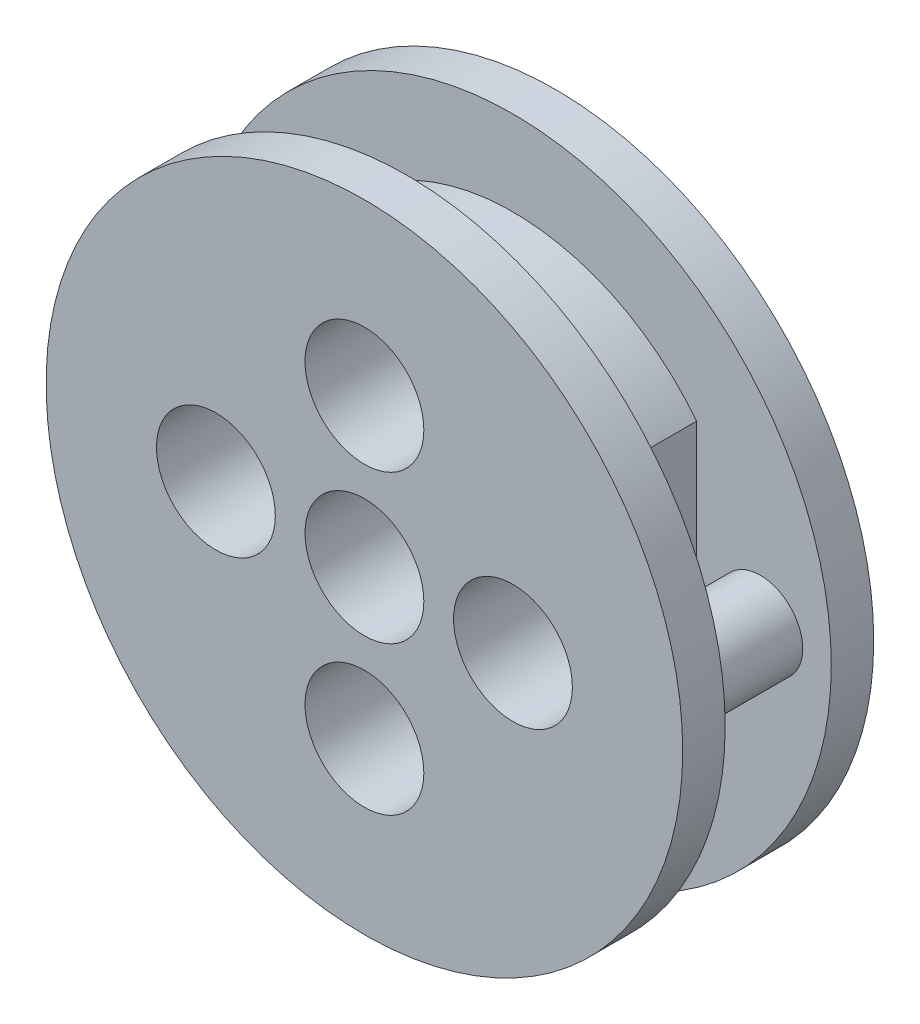
ISO-10303-21;
HEADER;
FILE_DESCRIPTION(('STEP AP214'),'2;1');
FILE_NAME('part.step','',(''),(''),'','','');
FILE_SCHEMA(('AUTOMOTIVE_DESIGN { 1 0 10303 214 1 1 1 1 }'));
ENDSEC;
DATA;
#1=APPLICATION_CONTEXT('core data for automotive mechanical design processes');
#2=APPLICATION_PROTOCOL_DEFINITION('international standard','automotive_design',2000,#1);
#3=PRODUCT_CONTEXT('',#1,'mechanical');
#4=PRODUCT('Part','Part','',(#3));
#5=PRODUCT_RELATED_PRODUCT_CATEGORY('part','',(#4));
#6=PRODUCT_DEFINITION_FORMATION('','',#4);
#7=PRODUCT_DEFINITION_CONTEXT('part definition',#1,'design');
#8=PRODUCT_DEFINITION('design','',#6,#7);
#9=PRODUCT_DEFINITION_SHAPE('','',#8);
#10=(LENGTH_UNIT() NAMED_UNIT(*) SI_UNIT(.MILLI.,.METRE.));
#11=(NAMED_UNIT(*) PLANE_ANGLE_UNIT() SI_UNIT($,.RADIAN.));
#12=(NAMED_UNIT(*) SI_UNIT($,.STERADIAN.) SOLID_ANGLE_UNIT());
#13=UNCERTAINTY_MEASURE_WITH_UNIT(LENGTH_MEASURE(1.E-05),#10,'distance_accuracy_value','');
#14=(GEOMETRIC_REPRESENTATION_CONTEXT(3) GLOBAL_UNCERTAINTY_ASSIGNED_CONTEXT((#13)) GLOBAL_UNIT_ASSIGNED_CONTEXT((#10,
#11,#12)) REPRESENTATION_CONTEXT('',''));
#15=CARTESIAN_POINT('',(0.,0.,0.));
#16=DIRECTION('',(0.,0.,1.));
#17=DIRECTION('',(1.,0.,0.));
#18=AXIS2_PLACEMENT_3D('',#15,#16,#17);
#19=CARTESIAN_POINT('',(0.,-7.,9.001));
#20=DIRECTION('',(0.,0.,-1.));
#21=DIRECTION('',(-1.,0.,0.));
#22=AXIS2_PLACEMENT_3D('',#19,#20,#21);
#23=CYLINDRICAL_SURFACE('',#22,1.5);
#24=CARTESIAN_POINT('',(0.,-7.,0.));
#25=DIRECTION('',(0.,0.,-1.));
#26=DIRECTION('',(1.,0.,0.));
#27=AXIS2_PLACEMENT_3D('',#24,#25,#26);
#28=CIRCLE('',#27,1.5);
#29=CARTESIAN_POINT('',(1.5,-7.,0.));
#30=VERTEX_POINT('',#29);
#31=EDGE_CURVE('E130',#30,#30,#28,.T.);
#32=ORIENTED_EDGE('',*,*,#31,.T.);
#33=EDGE_LOOP('',(#32));
#34=FACE_BOUND('',#33,.T.);
#35=CARTESIAN_POINT('',(0.,-7.,4.));
#36=DIRECTION('',(0.,0.,1.));
#37=DIRECTION('',(1.,0.,0.));
#38=AXIS2_PLACEMENT_3D('',#35,#36,#37);
#39=CIRCLE('',#38,1.5);
#40=CARTESIAN_POINT('',(1.5,-7.,4.));
#41=VERTEX_POINT('',#40);
#42=EDGE_CURVE('E120',#41,#41,#39,.F.);
#43=ORIENTED_EDGE('',*,*,#42,.F.);
#44=EDGE_LOOP('',(#43));
#45=FACE_BOUND('',#44,.T.);
#46=ADVANCED_FACE('F36',(#34,#45),#23,.F.);
#47=CARTESIAN_POINT('',(-7.,0.,9.001));
#48=DIRECTION('',(0.,0.,-1.));
#49=DIRECTION('',(-1.,0.,0.));
#50=AXIS2_PLACEMENT_3D('',#47,#48,#49);
#51=CYLINDRICAL_SURFACE('',#50,1.5);
#52=CARTESIAN_POINT('',(-7.,0.,0.));
#53=DIRECTION('',(0.,0.,-1.));
#54=DIRECTION('',(-1.,0.,0.));
#55=AXIS2_PLACEMENT_3D('',#52,#53,#54);
#56=CIRCLE('',#55,1.5);
#57=CARTESIAN_POINT('',(-8.5,0.,0.));
#58=VERTEX_POINT('',#57);
#59=EDGE_CURVE('E134',#58,#58,#56,.T.);
#60=ORIENTED_EDGE('',*,*,#59,.T.);
#61=EDGE_LOOP('',(#60));
#62=FACE_BOUND('',#61,.T.);
#63=CARTESIAN_POINT('',(-7.,0.,4.));
#64=DIRECTION('',(0.,0.,1.));
#65=DIRECTION('',(1.,0.,0.));
#66=AXIS2_PLACEMENT_3D('',#63,#64,#65);
#67=CIRCLE('',#66,1.5);
#68=CARTESIAN_POINT('',(-5.5,0.,4.));
#69=VERTEX_POINT('',#68);
#70=EDGE_CURVE('E110',#69,#69,#67,.F.);
#71=ORIENTED_EDGE('',*,*,#70,.F.);
#72=EDGE_LOOP('',(#71));
#73=FACE_BOUND('',#72,.T.);
#74=ADVANCED_FACE('F186',(#62,#73),#51,.F.);
#75=CARTESIAN_POINT('',(7.,0.,9.001));
#76=DIRECTION('',(0.,0.,-1.));
#77=DIRECTION('',(-1.,0.,0.));
#78=AXIS2_PLACEMENT_3D('',#75,#76,#77);
#79=CYLINDRICAL_SURFACE('',#78,1.5);
#80=CARTESIAN_POINT('',(7.,0.,0.));
#81=DIRECTION('',(0.,0.,-1.));
#82=DIRECTION('',(1.,0.,0.));
#83=AXIS2_PLACEMENT_3D('',#80,#81,#82);
#84=CIRCLE('',#83,1.5);
#85=CARTESIAN_POINT('',(8.5,0.,0.));
#86=VERTEX_POINT('',#85);
#87=EDGE_CURVE('E131',#86,#86,#84,.T.);
#88=ORIENTED_EDGE('',*,*,#87,.T.);
#89=EDGE_LOOP('',(#88));
#90=FACE_BOUND('',#89,.T.);
#91=CARTESIAN_POINT('',(7.,0.,4.));
#92=DIRECTION('',(0.,0.,1.));
#93=DIRECTION('',(1.,0.,0.));
#94=AXIS2_PLACEMENT_3D('',#91,#92,#93);
#95=CIRCLE('',#94,1.5);
#96=CARTESIAN_POINT('',(8.5,0.,4.));
#97=VERTEX_POINT('',#96);
#98=EDGE_CURVE('E108',#97,#97,#95,.F.);
#99=ORIENTED_EDGE('',*,*,#98,.F.);
#100=EDGE_LOOP('',(#99));
#101=FACE_BOUND('',#100,.T.);
#102=ADVANCED_FACE('F192',(#90,#101),#79,.F.);
#103=CARTESIAN_POINT('',(0.,7.,9.001));
#104=DIRECTION('',(0.,0.,-1.));
#105=DIRECTION('',(-1.,0.,0.));
#106=AXIS2_PLACEMENT_3D('',#103,#104,#105);
#107=CYLINDRICAL_SURFACE('',#106,1.5);
#108=CARTESIAN_POINT('',(0.,7.,0.));
#109=DIRECTION('',(0.,0.,-1.));
#110=DIRECTION('',(-1.,0.,0.));
#111=AXIS2_PLACEMENT_3D('',#108,#109,#110);
#112=CIRCLE('',#111,1.5);
#113=CARTESIAN_POINT('',(-1.5,7.,0.));
#114=VERTEX_POINT('',#113);
#115=EDGE_CURVE('E126',#114,#114,#112,.T.);
#116=ORIENTED_EDGE('',*,*,#115,.T.);
#117=EDGE_LOOP('',(#116));
#118=FACE_BOUND('',#117,.T.);
#119=CARTESIAN_POINT('',(0.,7.,4.));
#120=DIRECTION('',(0.,0.,1.));
#121=DIRECTION('',(1.,0.,0.));
#122=AXIS2_PLACEMENT_3D('',#119,#120,#121);
#123=CIRCLE('',#122,1.5);
#124=CARTESIAN_POINT('',(1.5,7.,4.));
#125=VERTEX_POINT('',#124);
#126=EDGE_CURVE('E113',#125,#125,#123,.F.);
#127=ORIENTED_EDGE('',*,*,#126,.F.);
#128=EDGE_LOOP('',(#127));
#129=FACE_BOUND('',#128,.T.);
#130=ADVANCED_FACE('F242',(#118,#129),#107,.F.);
#131=CARTESIAN_POINT('',(0.,0.,2.));
#132=DIRECTION('',(0.,0.,-1.));
#133=DIRECTION('',(-1.,0.,0.));
#134=AXIS2_PLACEMENT_3D('',#131,#132,#133);
#135=CYLINDRICAL_SURFACE('',#134,15.);
#136=CARTESIAN_POINT('',(0.,0.,2.));
#137=DIRECTION('',(0.,0.,1.));
#138=DIRECTION('',(1.,0.,0.));
#139=AXIS2_PLACEMENT_3D('',#136,#137,#138);
#140=CIRCLE('',#139,15.);
#141=CARTESIAN_POINT('',(15.,0.,2.));
#142=VERTEX_POINT('',#141);
#143=EDGE_CURVE('E171',#142,#142,#140,.T.);
#144=ORIENTED_EDGE('',*,*,#143,.F.);
#145=EDGE_LOOP('',(#144));
#146=FACE_BOUND('',#145,.T.);
#147=CARTESIAN_POINT('',(0.,0.,0.));
#148=DIRECTION('',(0.,0.,1.));
#149=DIRECTION('',(1.,0.,0.));
#150=AXIS2_PLACEMENT_3D('',#147,#148,#149);
#151=CIRCLE('',#150,15.);
#152=CARTESIAN_POINT('',(15.,0.,0.));
#153=VERTEX_POINT('',#152);
#154=EDGE_CURVE('E170',#153,#153,#151,.T.);
#155=ORIENTED_EDGE('',*,*,#154,.T.);
#156=EDGE_LOOP('',(#155));
#157=FACE_BOUND('',#156,.T.);
#158=ADVANCED_FACE('F38',(#146,#157),#135,.T.);
#159=CARTESIAN_POINT('',(0.,0.,2.));
#160=DIRECTION('',(0.,0.,1.));
#161=DIRECTION('',(1.,0.,0.));
#162=AXIS2_PLACEMENT_3D('',#159,#160,#161);
#163=PLANE('',#162);
#164=CARTESIAN_POINT('',(11.6558677167642,0.,2.));
#165=DIRECTION('',(0.,0.,1.));
#166=DIRECTION('',(1.,0.,0.));
#167=AXIS2_PLACEMENT_3D('',#164,#165,#166);
#168=CIRCLE('',#167,2.);
#169=CARTESIAN_POINT('',(13.6558677167642,0.,2.));
#170=VERTEX_POINT('',#169);
#171=EDGE_CURVE('E147',#170,#170,#168,.T.);
#172=ORIENTED_EDGE('',*,*,#171,.F.);
#173=EDGE_LOOP('',(#172));
#174=FACE_BOUND('',#173,.T.);
#175=CARTESIAN_POINT('',(0.,0.,2.));
#176=DIRECTION('',(0.,0.,1.));
#177=DIRECTION('',(1.,0.,0.));
#178=AXIS2_PLACEMENT_3D('',#175,#176,#177);
#179=CIRCLE('',#178,11.);
#180=CARTESIAN_POINT('',(8.65586771676423,6.78792708195063,2.));
#181=VERTEX_POINT('',#180);
#182=CARTESIAN_POINT('',(8.65586771676423,-6.78792708195063,2.));
#183=VERTEX_POINT('',#182);
#184=EDGE_CURVE('E152',#181,#183,#179,.T.);
#185=ORIENTED_EDGE('',*,*,#184,.F.);
#186=DIRECTION('',(0.,1.,0.));
#187=VECTOR('',#186,1.);
#188=CARTESIAN_POINT('',(8.65586771676423,6.78792708195063,2.));
#189=LINE('',#188,#187);
#190=EDGE_CURVE('E58',#183,#181,#189,.T.);
#191=ORIENTED_EDGE('',*,*,#190,.F.);
#192=EDGE_LOOP('',(#185,#191));
#193=FACE_BOUND('',#192,.T.);
#194=ORIENTED_EDGE('',*,*,#143,.T.);
#195=EDGE_LOOP('',(#194));
#196=FACE_BOUND('',#195,.T.);
#197=ADVANCED_FACE('F222',(#174,#193,#196),#163,.T.);
#198=CARTESIAN_POINT('',(0.,0.,0.));
#199=DIRECTION('',(0.,0.,1.));
#200=DIRECTION('',(1.,0.,0.));
#201=AXIS2_PLACEMENT_3D('',#198,#199,#200);
#202=PLANE('',#201);
#203=ORIENTED_EDGE('',*,*,#115,.F.);
#204=EDGE_LOOP('',(#203));
#205=FACE_BOUND('',#204,.T.);
#206=CARTESIAN_POINT('',(0.,0.,0.));
#207=DIRECTION('',(0.,0.,-1.));
#208=DIRECTION('',(-1.,0.,0.));
#209=AXIS2_PLACEMENT_3D('',#206,#207,#208);
#210=CIRCLE('',#209,2.8);
#211=CARTESIAN_POINT('',(-2.8,0.,0.));
#212=VERTEX_POINT('',#211);
#213=EDGE_CURVE('E135',#212,#212,#210,.T.);
#214=ORIENTED_EDGE('',*,*,#213,.F.);
#215=EDGE_LOOP('',(#214));
#216=FACE_BOUND('',#215,.T.);
#217=ORIENTED_EDGE('',*,*,#87,.F.);
#218=EDGE_LOOP('',(#217));
#219=FACE_BOUND('',#218,.T.);
#220=ORIENTED_EDGE('',*,*,#59,.F.);
#221=EDGE_LOOP('',(#220));
#222=FACE_BOUND('',#221,.T.);
#223=ORIENTED_EDGE('',*,*,#31,.F.);
#224=EDGE_LOOP('',(#223));
#225=FACE_BOUND('',#224,.T.);
#226=ORIENTED_EDGE('',*,*,#154,.F.);
#227=EDGE_LOOP('',(#226));
#228=FACE_BOUND('',#227,.T.);
#229=ADVANCED_FACE('F220',(#205,#216,#219,#222,#225,#228),#202,.F.);
#230=CARTESIAN_POINT('',(0.,0.,7.));
#231=DIRECTION('',(0.,0.,-1.));
#232=DIRECTION('',(-1.,0.,0.));
#233=AXIS2_PLACEMENT_3D('',#230,#231,#232);
#234=CYLINDRICAL_SURFACE('',#233,11.);
#235=ORIENTED_EDGE('',*,*,#184,.T.);
#236=DIRECTION('',(0.,0.,-1.));
#237=VECTOR('',#236,1.);
#238=CARTESIAN_POINT('',(8.65586771676423,-6.78792708195063,7.));
#239=LINE('',#238,#237);
#240=CARTESIAN_POINT('',(8.65586771676423,-6.78792708195063,7.));
#241=VERTEX_POINT('',#240);
#242=EDGE_CURVE('E168',#241,#183,#239,.T.);
#243=ORIENTED_EDGE('',*,*,#242,.F.);
#244=CARTESIAN_POINT('',(0.,0.,7.));
#245=DIRECTION('',(0.,0.,1.));
#246=DIRECTION('',(1.,0.,0.));
#247=AXIS2_PLACEMENT_3D('',#244,#245,#246);
#248=CIRCLE('',#247,11.);
#249=CARTESIAN_POINT('',(8.65586771676423,6.78792708195063,7.));
#250=VERTEX_POINT('',#249);
#251=EDGE_CURVE('E155',#250,#241,#248,.T.);
#252=ORIENTED_EDGE('',*,*,#251,.F.);
#253=DIRECTION('',(0.,0.,-1.));
#254=VECTOR('',#253,1.);
#255=CARTESIAN_POINT('',(8.65586771676423,6.78792708195063,7.));
#256=LINE('',#255,#254);
#257=EDGE_CURVE('E162',#250,#181,#256,.T.);
#258=ORIENTED_EDGE('',*,*,#257,.T.);
#259=EDGE_LOOP('',(#235,#243,#252,#258));
#260=FACE_BOUND('',#259,.T.);
#261=ADVANCED_FACE('F216',(#260),#234,.T.);
#262=CARTESIAN_POINT('',(8.65586771676423,6.78792708195063,7.));
#263=DIRECTION('',(-1.,0.,0.));
#264=DIRECTION('',(0.,0.,1.));
#265=AXIS2_PLACEMENT_3D('',#262,#263,#264);
#266=PLANE('',#265);
#267=DIRECTION('',(0.,1.,0.));
#268=VECTOR('',#267,1.);
#269=CARTESIAN_POINT('',(8.65586771676423,6.78792708195063,4.));
#270=LINE('',#269,#268);
#271=CARTESIAN_POINT('',(8.65586771676423,-2.25789771791771,4.));
#272=VERTEX_POINT('',#271);
#273=CARTESIAN_POINT('',(8.65586771676423,2.25789771791771,4.));
#274=VERTEX_POINT('',#273);
#275=EDGE_CURVE('E107',#272,#274,#270,.T.);
#276=ORIENTED_EDGE('',*,*,#275,.F.);
#277=DIRECTION('',(0.,0.,1.));
#278=VECTOR('',#277,1.);
#279=CARTESIAN_POINT('',(8.65586771676423,-2.25789771791771,4.));
#280=LINE('',#279,#278);
#281=CARTESIAN_POINT('',(8.65586771676423,-2.25789771791771,7.));
#282=VERTEX_POINT('',#281);
#283=EDGE_CURVE('E97',#272,#282,#280,.T.);
#284=ORIENTED_EDGE('',*,*,#283,.T.);
#285=DIRECTION('',(0.,1.,0.));
#286=VECTOR('',#285,1.);
#287=CARTESIAN_POINT('',(8.65586771676423,6.78792708195063,7.));
#288=LINE('',#287,#286);
#289=EDGE_CURVE('E159',#241,#282,#288,.T.);
#290=ORIENTED_EDGE('',*,*,#289,.F.);
#291=ORIENTED_EDGE('',*,*,#242,.T.);
#292=ORIENTED_EDGE('',*,*,#190,.T.);
#293=ORIENTED_EDGE('',*,*,#257,.F.);
#294=CARTESIAN_POINT('',(8.65586771676423,2.25789771791771,7.));
#295=VERTEX_POINT('',#294);
#296=EDGE_CURVE('E158',#295,#250,#288,.T.);
#297=ORIENTED_EDGE('',*,*,#296,.F.);
#298=DIRECTION('',(0.,0.,1.));
#299=VECTOR('',#298,1.);
#300=CARTESIAN_POINT('',(8.65586771676423,2.25789771791771,4.));
#301=LINE('',#300,#299);
#302=EDGE_CURVE('E96',#295,#274,#301,.F.);
#303=ORIENTED_EDGE('',*,*,#302,.T.);
#304=EDGE_LOOP('',(#276,#284,#290,#291,#292,#293,#297,#303));
#305=FACE_BOUND('',#304,.T.);
#306=ADVANCED_FACE('F213',(#305),#266,.F.);
#307=CARTESIAN_POINT('',(11.6558677167642,0.,7.));
#308=DIRECTION('',(0.,0.,-1.));
#309=DIRECTION('',(-1.,0.,0.));
#310=AXIS2_PLACEMENT_3D('',#307,#308,#309);
#311=CYLINDRICAL_SURFACE('',#310,2.);
#312=CARTESIAN_POINT('',(11.6558677167642,0.,4.));
#313=DIRECTION('',(0.,0.,1.));
#314=DIRECTION('',(1.,0.,0.));
#315=AXIS2_PLACEMENT_3D('',#312,#313,#314);
#316=CIRCLE('',#315,2.);
#317=CARTESIAN_POINT('',(9.74031670875536,0.575034203953288,4.));
#318=VERTEX_POINT('',#317);
#319=CARTESIAN_POINT('',(9.74031670875536,-0.575034203953288,4.));
#320=VERTEX_POINT('',#319);
#321=EDGE_CURVE('E101',#318,#320,#316,.T.);
#322=ORIENTED_EDGE('',*,*,#321,.F.);
#323=DIRECTION('',(0.,0.,1.));
#324=VECTOR('',#323,1.);
#325=CARTESIAN_POINT('',(9.74031670875536,0.575034203953289,6.5));
#326=LINE('',#325,#324);
#327=CARTESIAN_POINT('',(9.74031670875536,0.575034203953288,7.));
#328=VERTEX_POINT('',#327);
#329=EDGE_CURVE('E88',#318,#328,#326,.T.);
#330=ORIENTED_EDGE('',*,*,#329,.T.);
#331=CARTESIAN_POINT('',(11.6558677167642,0.,7.));
#332=DIRECTION('',(0.,0.,1.));
#333=DIRECTION('',(1.,0.,0.));
#334=AXIS2_PLACEMENT_3D('',#331,#332,#333);
#335=CIRCLE('',#334,2.);
#336=CARTESIAN_POINT('',(9.74031670875536,-0.575034203953288,7.));
#337=VERTEX_POINT('',#336);
#338=EDGE_CURVE('E150',#337,#328,#335,.T.);
#339=ORIENTED_EDGE('',*,*,#338,.F.);
#340=DIRECTION('',(0.,0.,1.));
#341=VECTOR('',#340,1.);
#342=CARTESIAN_POINT('',(9.74031670875536,-0.575034203953289,6.5));
#343=LINE('',#342,#341);
#344=EDGE_CURVE('E51',#337,#320,#343,.F.);
#345=ORIENTED_EDGE('',*,*,#344,.T.);
#346=EDGE_LOOP('',(#322,#330,#339,#345));
#347=FACE_BOUND('',#346,.T.);
#348=ORIENTED_EDGE('',*,*,#171,.T.);
#349=EDGE_LOOP('',(#348));
#350=FACE_BOUND('',#349,.T.);
#351=ADVANCED_FACE('F105',(#347,#350),#311,.T.);
#352=CARTESIAN_POINT('',(0.,0.,9.));
#353=DIRECTION('',(0.,0.,-1.));
#354=DIRECTION('',(-1.,0.,0.));
#355=AXIS2_PLACEMENT_3D('',#352,#353,#354);
#356=CYLINDRICAL_SURFACE('',#355,15.);
#357=CARTESIAN_POINT('',(0.,0.,9.));
#358=DIRECTION('',(0.,0.,1.));
#359=DIRECTION('',(1.,0.,0.));
#360=AXIS2_PLACEMENT_3D('',#357,#358,#359);
#361=CIRCLE('',#360,15.);
#362=CARTESIAN_POINT('',(15.,0.,9.));
#363=VERTEX_POINT('',#362);
#364=EDGE_CURVE('E144',#363,#363,#361,.T.);
#365=ORIENTED_EDGE('',*,*,#364,.F.);
#366=EDGE_LOOP('',(#365));
#367=FACE_BOUND('',#366,.T.);
#368=CARTESIAN_POINT('',(0.,0.,7.));
#369=DIRECTION('',(0.,0.,1.));
#370=DIRECTION('',(1.,0.,0.));
#371=AXIS2_PLACEMENT_3D('',#368,#369,#370);
#372=CIRCLE('',#371,15.);
#373=CARTESIAN_POINT('',(15.,0.,7.));
#374=VERTEX_POINT('',#373);
#375=EDGE_CURVE('E129',#374,#374,#372,.T.);
#376=ORIENTED_EDGE('',*,*,#375,.T.);
#377=EDGE_LOOP('',(#376));
#378=FACE_BOUND('',#377,.T.);
#379=ADVANCED_FACE('F203',(#367,#378),#356,.T.);
#380=CARTESIAN_POINT('',(0.,0.,9.));
#381=DIRECTION('',(0.,0.,1.));
#382=DIRECTION('',(1.,0.,0.));
#383=AXIS2_PLACEMENT_3D('',#380,#381,#382);
#384=PLANE('',#383);
#385=CARTESIAN_POINT('',(0.,7.,9.));
#386=DIRECTION('',(0.,0.,1.));
#387=DIRECTION('',(1.,0.,0.));
#388=AXIS2_PLACEMENT_3D('',#385,#386,#387);
#389=CIRCLE('',#388,2.8);
#390=CARTESIAN_POINT('',(2.8,7.,9.));
#391=VERTEX_POINT('',#390);
#392=EDGE_CURVE('E294',#391,#391,#389,.T.);
#393=ORIENTED_EDGE('',*,*,#392,.F.);
#394=EDGE_LOOP('',(#393));
#395=FACE_BOUND('',#394,.T.);
#396=CARTESIAN_POINT('',(7.,0.,9.));
#397=DIRECTION('',(0.,0.,1.));
#398=DIRECTION('',(1.,0.,0.));
#399=AXIS2_PLACEMENT_3D('',#396,#397,#398);
#400=CIRCLE('',#399,2.8);
#401=CARTESIAN_POINT('',(9.8,0.,9.));
#402=VERTEX_POINT('',#401);
#403=EDGE_CURVE('E103',#402,#402,#400,.T.);
#404=ORIENTED_EDGE('',*,*,#403,.F.);
#405=EDGE_LOOP('',(#404));
#406=FACE_BOUND('',#405,.T.);
#407=CARTESIAN_POINT('',(-7.,0.,9.));
#408=DIRECTION('',(0.,0.,1.));
#409=DIRECTION('',(1.,0.,0.));
#410=AXIS2_PLACEMENT_3D('',#407,#408,#409);
#411=CIRCLE('',#410,2.8);
#412=CARTESIAN_POINT('',(-4.2,0.,9.));
#413=VERTEX_POINT('',#412);
#414=EDGE_CURVE('E304',#413,#413,#411,.T.);
#415=ORIENTED_EDGE('',*,*,#414,.F.);
#416=EDGE_LOOP('',(#415));
#417=FACE_BOUND('',#416,.T.);
#418=CARTESIAN_POINT('',(0.,-7.,9.));
#419=DIRECTION('',(0.,0.,1.));
#420=DIRECTION('',(1.,0.,0.));
#421=AXIS2_PLACEMENT_3D('',#418,#419,#420);
#422=CIRCLE('',#421,2.8);
#423=CARTESIAN_POINT('',(2.8,-7.,9.));
#424=VERTEX_POINT('',#423);
#425=EDGE_CURVE('E116',#424,#424,#422,.T.);
#426=ORIENTED_EDGE('',*,*,#425,.F.);
#427=EDGE_LOOP('',(#426));
#428=FACE_BOUND('',#427,.T.);
#429=CARTESIAN_POINT('',(0.,0.,9.));
#430=DIRECTION('',(0.,0.,1.));
#431=DIRECTION('',(1.,0.,0.));
#432=AXIS2_PLACEMENT_3D('',#429,#430,#431);
#433=CIRCLE('',#432,2.8);
#434=CARTESIAN_POINT('',(2.8,0.,9.));
#435=VERTEX_POINT('',#434);
#436=EDGE_CURVE('E125',#435,#435,#433,.F.);
#437=ORIENTED_EDGE('',*,*,#436,.T.);
#438=EDGE_LOOP('',(#437));
#439=FACE_BOUND('',#438,.T.);
#440=ORIENTED_EDGE('',*,*,#364,.T.);
#441=EDGE_LOOP('',(#440));
#442=FACE_BOUND('',#441,.T.);
#443=ADVANCED_FACE('F199',(#395,#406,#417,#428,#439,#442),#384,.T.);
#444=CARTESIAN_POINT('',(0.,0.,7.));
#445=DIRECTION('',(0.,0.,1.));
#446=DIRECTION('',(1.,0.,0.));
#447=AXIS2_PLACEMENT_3D('',#444,#445,#446);
#448=PLANE('',#447);
#449=ORIENTED_EDGE('',*,*,#338,.T.);
#450=CARTESIAN_POINT('',(7.,0.,7.));
#451=DIRECTION('',(0.,0.,1.));
#452=DIRECTION('',(1.,0.,0.));
#453=AXIS2_PLACEMENT_3D('',#450,#451,#452);
#454=CIRCLE('',#453,2.8);
#455=EDGE_CURVE('E11',#328,#295,#454,.T.);
#456=ORIENTED_EDGE('',*,*,#455,.T.);
#457=ORIENTED_EDGE('',*,*,#296,.T.);
#458=ORIENTED_EDGE('',*,*,#251,.T.);
#459=ORIENTED_EDGE('',*,*,#289,.T.);
#460=EDGE_CURVE('E40',#282,#337,#454,.T.);
#461=ORIENTED_EDGE('',*,*,#460,.T.);
#462=EDGE_LOOP('',(#449,#456,#457,#458,#459,#461));
#463=FACE_BOUND('',#462,.T.);
#464=ORIENTED_EDGE('',*,*,#375,.F.);
#465=EDGE_LOOP('',(#464));
#466=FACE_BOUND('',#465,.T.);
#467=ADVANCED_FACE('F202',(#463,#466),#448,.F.);
#468=CARTESIAN_POINT('',(0.,0.,9.001));
#469=DIRECTION('',(0.,0.,-1.));
#470=DIRECTION('',(-1.,0.,0.));
#471=AXIS2_PLACEMENT_3D('',#468,#469,#470);
#472=CYLINDRICAL_SURFACE('',#471,2.8);
#473=ORIENTED_EDGE('',*,*,#436,.F.);
#474=EDGE_LOOP('',(#473));
#475=FACE_BOUND('',#474,.T.);
#476=ORIENTED_EDGE('',*,*,#213,.T.);
#477=EDGE_LOOP('',(#476));
#478=FACE_BOUND('',#477,.T.);
#479=ADVANCED_FACE('F196',(#475,#478),#472,.F.);
#480=CARTESIAN_POINT('',(0.,7.,4.));
#481=DIRECTION('',(0.,0.,1.));
#482=DIRECTION('',(1.,0.,0.));
#483=AXIS2_PLACEMENT_3D('',#480,#481,#482);
#484=PLANE('',#483);
#485=CARTESIAN_POINT('',(0.,7.,4.));
#486=DIRECTION('',(0.,0.,1.));
#487=DIRECTION('',(1.,0.,0.));
#488=AXIS2_PLACEMENT_3D('',#485,#486,#487);
#489=CIRCLE('',#488,2.8);
#490=CARTESIAN_POINT('',(2.8,7.,4.));
#491=VERTEX_POINT('',#490);
#492=EDGE_CURVE('E177',#491,#491,#489,.T.);
#493=ORIENTED_EDGE('',*,*,#492,.T.);
#494=EDGE_LOOP('',(#493));
#495=FACE_BOUND('',#494,.T.);
#496=ORIENTED_EDGE('',*,*,#126,.T.);
#497=EDGE_LOOP('',(#496));
#498=FACE_BOUND('',#497,.T.);
#499=ADVANCED_FACE('F282',(#495,#498),#484,.T.);
#500=CARTESIAN_POINT('',(0.,7.,4.));
#501=DIRECTION('',(0.,0.,1.));
#502=DIRECTION('',(1.,0.,0.));
#503=AXIS2_PLACEMENT_3D('',#500,#501,#502);
#504=CYLINDRICAL_SURFACE('',#503,2.8);
#505=ORIENTED_EDGE('',*,*,#492,.F.);
#506=EDGE_LOOP('',(#505));
#507=FACE_BOUND('',#506,.T.);
#508=ORIENTED_EDGE('',*,*,#392,.T.);
#509=EDGE_LOOP('',(#508));
#510=FACE_BOUND('',#509,.T.);
#511=ADVANCED_FACE('F275',(#507,#510),#504,.F.);
#512=CARTESIAN_POINT('',(7.,0.,4.));
#513=DIRECTION('',(0.,0.,1.));
#514=DIRECTION('',(1.,0.,0.));
#515=AXIS2_PLACEMENT_3D('',#512,#513,#514);
#516=CYLINDRICAL_SURFACE('',#515,2.8);
#517=ORIENTED_EDGE('',*,*,#403,.T.);
#518=EDGE_LOOP('',(#517));
#519=FACE_BOUND('',#518,.T.);
#520=ORIENTED_EDGE('',*,*,#455,.F.);
#521=ORIENTED_EDGE('',*,*,#329,.F.);
#522=CARTESIAN_POINT('',(7.,0.,4.));
#523=DIRECTION('',(0.,0.,1.));
#524=DIRECTION('',(1.,0.,0.));
#525=AXIS2_PLACEMENT_3D('',#522,#523,#524);
#526=CIRCLE('',#525,2.8);
#527=EDGE_CURVE('E91',#320,#318,#526,.T.);
#528=ORIENTED_EDGE('',*,*,#527,.F.);
#529=ORIENTED_EDGE('',*,*,#344,.F.);
#530=ORIENTED_EDGE('',*,*,#460,.F.);
#531=ORIENTED_EDGE('',*,*,#283,.F.);
#532=EDGE_CURVE('E102',#274,#272,#526,.T.);
#533=ORIENTED_EDGE('',*,*,#532,.F.);
#534=ORIENTED_EDGE('',*,*,#302,.F.);
#535=EDGE_LOOP('',(#520,#521,#528,#529,#530,#531,#533,#534));
#536=FACE_BOUND('',#535,.T.);
#537=ADVANCED_FACE('F90',(#519,#536),#516,.F.);
#538=CARTESIAN_POINT('',(7.,0.,4.));
#539=DIRECTION('',(0.,0.,1.));
#540=DIRECTION('',(1.,0.,0.));
#541=AXIS2_PLACEMENT_3D('',#538,#539,#540);
#542=PLANE('',#541);
#543=ORIENTED_EDGE('',*,*,#98,.T.);
#544=EDGE_LOOP('',(#543));
#545=FACE_BOUND('',#544,.T.);
#546=ORIENTED_EDGE('',*,*,#275,.T.);
#547=ORIENTED_EDGE('',*,*,#532,.T.);
#548=EDGE_LOOP('',(#546,#547));
#549=FACE_BOUND('',#548,.T.);
#550=ADVANCED_FACE('F274',(#545,#549),#542,.T.);
#551=ORIENTED_EDGE('',*,*,#321,.T.);
#552=ORIENTED_EDGE('',*,*,#527,.T.);
#553=EDGE_LOOP('',(#551,#552));
#554=FACE_BOUND('',#553,.T.);
#555=ADVANCED_FACE('F100',(#554),#542,.T.);
#556=CARTESIAN_POINT('',(-7.,0.,4.));
#557=DIRECTION('',(0.,0.,1.));
#558=DIRECTION('',(1.,0.,0.));
#559=AXIS2_PLACEMENT_3D('',#556,#557,#558);
#560=PLANE('',#559);
#561=CARTESIAN_POINT('',(-7.,0.,4.));
#562=DIRECTION('',(0.,0.,1.));
#563=DIRECTION('',(1.,0.,0.));
#564=AXIS2_PLACEMENT_3D('',#561,#562,#563);
#565=CIRCLE('',#564,2.8);
#566=CARTESIAN_POINT('',(-4.2,0.,4.));
#567=VERTEX_POINT('',#566);
#568=EDGE_CURVE('E301',#567,#567,#565,.T.);
#569=ORIENTED_EDGE('',*,*,#568,.T.);
#570=EDGE_LOOP('',(#569));
#571=FACE_BOUND('',#570,.T.);
#572=ORIENTED_EDGE('',*,*,#70,.T.);
#573=EDGE_LOOP('',(#572));
#574=FACE_BOUND('',#573,.T.);
#575=ADVANCED_FACE('F267',(#571,#574),#560,.T.);
#576=CARTESIAN_POINT('',(-7.,0.,4.));
#577=DIRECTION('',(0.,0.,1.));
#578=DIRECTION('',(1.,0.,0.));
#579=AXIS2_PLACEMENT_3D('',#576,#577,#578);
#580=CYLINDRICAL_SURFACE('',#579,2.8);
#581=ORIENTED_EDGE('',*,*,#568,.F.);
#582=EDGE_LOOP('',(#581));
#583=FACE_BOUND('',#582,.T.);
#584=ORIENTED_EDGE('',*,*,#414,.T.);
#585=EDGE_LOOP('',(#584));
#586=FACE_BOUND('',#585,.T.);
#587=ADVANCED_FACE('F263',(#583,#586),#580,.F.);
#588=CARTESIAN_POINT('',(0.,-7.,4.));
#589=DIRECTION('',(0.,0.,1.));
#590=DIRECTION('',(1.,0.,0.));
#591=AXIS2_PLACEMENT_3D('',#588,#589,#590);
#592=PLANE('',#591);
#593=CARTESIAN_POINT('',(0.,-7.,4.));
#594=DIRECTION('',(0.,0.,1.));
#595=DIRECTION('',(1.,0.,0.));
#596=AXIS2_PLACEMENT_3D('',#593,#594,#595);
#597=CIRCLE('',#596,2.8);
#598=CARTESIAN_POINT('',(2.8,-7.,4.));
#599=VERTEX_POINT('',#598);
#600=EDGE_CURVE('E306',#599,#599,#597,.T.);
#601=ORIENTED_EDGE('',*,*,#600,.T.);
#602=EDGE_LOOP('',(#601));
#603=FACE_BOUND('',#602,.T.);
#604=ORIENTED_EDGE('',*,*,#42,.T.);
#605=EDGE_LOOP('',(#604));
#606=FACE_BOUND('',#605,.T.);
#607=ADVANCED_FACE('F183',(#603,#606),#592,.T.);
#608=CARTESIAN_POINT('',(0.,-7.,4.));
#609=DIRECTION('',(0.,0.,1.));
#610=DIRECTION('',(1.,0.,0.));
#611=AXIS2_PLACEMENT_3D('',#608,#609,#610);
#612=CYLINDRICAL_SURFACE('',#611,2.8);
#613=ORIENTED_EDGE('',*,*,#600,.F.);
#614=EDGE_LOOP('',(#613));
#615=FACE_BOUND('',#614,.T.);
#616=ORIENTED_EDGE('',*,*,#425,.T.);
#617=EDGE_LOOP('',(#616));
#618=FACE_BOUND('',#617,.T.);
#619=ADVANCED_FACE('F257',(#615,#618),#612,.F.);
#620=CLOSED_SHELL('',(#46,#74,#102,#130,#158,#197,#229,#261,#306,#351,#379,#443,#467,#479,#499,
#511,#537,#550,#555,#575,#587,#607,#619));
#621=MANIFOLD_SOLID_BREP('B2',#620);
#622=ADVANCED_BREP_SHAPE_REPRESENTATION('',(#18,#621),#14);
#623=SHAPE_DEFINITION_REPRESENTATION(#9,#622);
ENDSEC;
END-ISO-10303-21;
